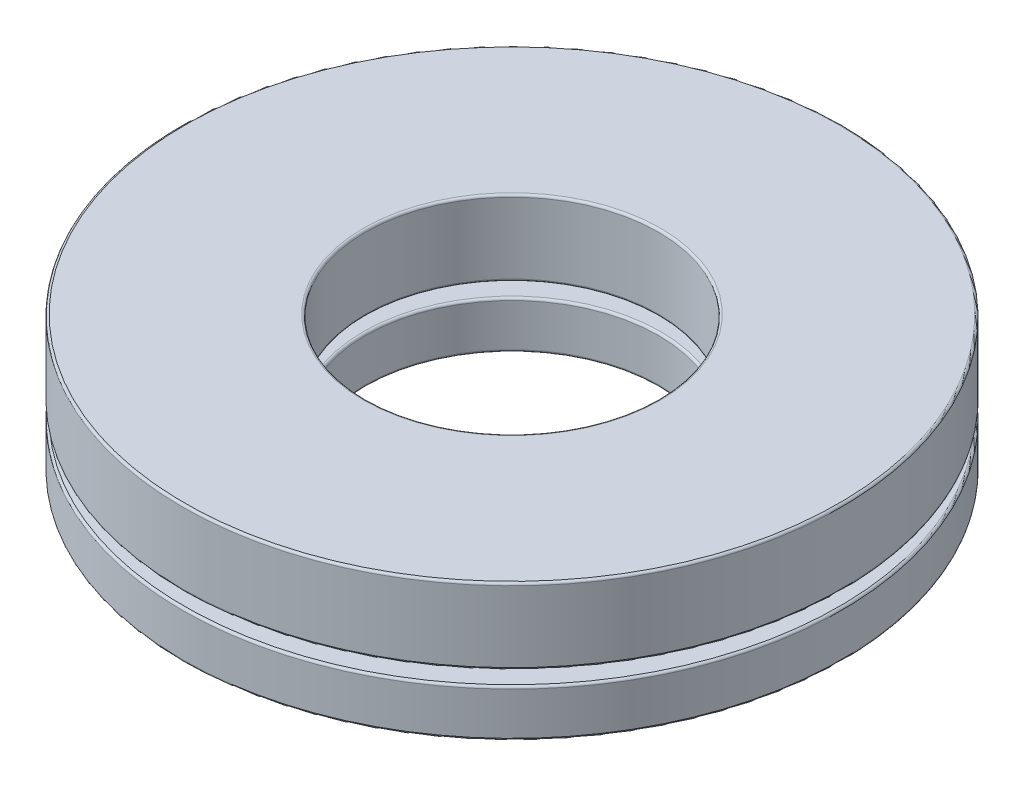
ISO-10303-21;
HEADER;
FILE_DESCRIPTION(('STEP AP214'),'2;1');
FILE_NAME('part.step','',(''),(''),'','','');
FILE_SCHEMA(('AUTOMOTIVE_DESIGN { 1 0 10303 214 1 1 1 1 }'));
ENDSEC;
DATA;
#1=APPLICATION_CONTEXT('core data for automotive mechanical design processes');
#2=APPLICATION_PROTOCOL_DEFINITION('international standard','automotive_design',2000,#1);
#3=PRODUCT_CONTEXT('',#1,'mechanical');
#4=PRODUCT('Part','Part','',(#3));
#5=PRODUCT_RELATED_PRODUCT_CATEGORY('part','',(#4));
#6=PRODUCT_DEFINITION_FORMATION('','',#4);
#7=PRODUCT_DEFINITION_CONTEXT('part definition',#1,'design');
#8=PRODUCT_DEFINITION('design','',#6,#7);
#9=PRODUCT_DEFINITION_SHAPE('','',#8);
#10=(LENGTH_UNIT() NAMED_UNIT(*) SI_UNIT(.MILLI.,.METRE.));
#11=(NAMED_UNIT(*) PLANE_ANGLE_UNIT() SI_UNIT($,.RADIAN.));
#12=(NAMED_UNIT(*) SI_UNIT($,.STERADIAN.) SOLID_ANGLE_UNIT());
#13=UNCERTAINTY_MEASURE_WITH_UNIT(LENGTH_MEASURE(1.E-05),#10,'distance_accuracy_value','');
#14=(GEOMETRIC_REPRESENTATION_CONTEXT(3) GLOBAL_UNCERTAINTY_ASSIGNED_CONTEXT((#13)) GLOBAL_UNIT_ASSIGNED_CONTEXT((#10,
#11,#12)) REPRESENTATION_CONTEXT('',''));
#15=CARTESIAN_POINT('',(0.,0.,0.));
#16=DIRECTION('',(0.,0.,1.));
#17=DIRECTION('',(1.,0.,0.));
#18=AXIS2_PLACEMENT_3D('',#15,#16,#17);
#19=CARTESIAN_POINT('',(0.,-2.4511,0.));
#20=DIRECTION('',(0.,-1.,0.));
#21=DIRECTION('',(0.,0.,-1.));
#22=AXIS2_PLACEMENT_3D('',#19,#20,#21);
#23=CYLINDRICAL_SURFACE('',#22,7.14375);
#24=CARTESIAN_POINT('',(0.,0.866055333333332,0.));
#25=DIRECTION('',(0.,1.,0.));
#26=DIRECTION('',(0.,0.,1.));
#27=AXIS2_PLACEMENT_3D('',#24,#25,#26);
#28=CIRCLE('',#27,7.14375);
#29=CARTESIAN_POINT('',(0.,0.866055333333332,7.14375));
#30=VERTEX_POINT('',#29);
#31=EDGE_CURVE('E11',#30,#30,#28,.T.);
#32=ORIENTED_EDGE('',*,*,#31,.T.);
#33=EDGE_LOOP('',(#32));
#34=FACE_BOUND('',#33,.T.);
#35=CARTESIAN_POINT('',(0.,2.402078,0.));
#36=DIRECTION('',(0.,-1.,0.));
#37=DIRECTION('',(0.,0.,-1.));
#38=AXIS2_PLACEMENT_3D('',#35,#36,#37);
#39=CIRCLE('',#38,7.14375);
#40=CARTESIAN_POINT('',(0.,2.402078,-7.14375));
#41=VERTEX_POINT('',#40);
#42=EDGE_CURVE('E44',#41,#41,#39,.T.);
#43=ORIENTED_EDGE('',*,*,#42,.T.);
#44=EDGE_LOOP('',(#43));
#45=FACE_BOUND('',#44,.T.);
#46=ADVANCED_FACE('F37',(#34,#45),#23,.T.);
#47=CARTESIAN_POINT('',(0.,2.4511,7.14375));
#48=DIRECTION('',(0.,-1.,0.));
#49=DIRECTION('',(0.,0.,-1.));
#50=AXIS2_PLACEMENT_3D('',#47,#48,#49);
#51=PLANE('',#50);
#52=CARTESIAN_POINT('',(0.,2.4511,0.));
#53=DIRECTION('',(0.,-1.,0.));
#54=DIRECTION('',(0.,0.,-1.));
#55=AXIS2_PLACEMENT_3D('',#52,#53,#54);
#56=CIRCLE('',#55,3.224022);
#57=CARTESIAN_POINT('',(0.,2.4511,-3.224022));
#58=VERTEX_POINT('',#57);
#59=EDGE_CURVE('E48',#58,#58,#56,.T.);
#60=ORIENTED_EDGE('',*,*,#59,.T.);
#61=EDGE_LOOP('',(#60));
#62=FACE_BOUND('',#61,.T.);
#63=CARTESIAN_POINT('',(0.,2.4511,0.));
#64=DIRECTION('',(0.,-1.,0.));
#65=DIRECTION('',(0.,0.,-1.));
#66=AXIS2_PLACEMENT_3D('',#63,#64,#65);
#67=CIRCLE('',#66,7.094728);
#68=CARTESIAN_POINT('',(0.,2.4511,-7.094728));
#69=VERTEX_POINT('',#68);
#70=EDGE_CURVE('E52',#69,#69,#67,.F.);
#71=ORIENTED_EDGE('',*,*,#70,.T.);
#72=EDGE_LOOP('',(#71));
#73=FACE_BOUND('',#72,.T.);
#74=ADVANCED_FACE('F80',(#62,#73),#51,.F.);
#75=CARTESIAN_POINT('',(0.,-2.4511,0.));
#76=DIRECTION('',(0.,-1.,0.));
#77=DIRECTION('',(0.,0.,-1.));
#78=AXIS2_PLACEMENT_3D('',#75,#76,#77);
#79=CYLINDRICAL_SURFACE('',#78,3.175);
#80=CARTESIAN_POINT('',(0.,0.866055333333332,0.));
#81=DIRECTION('',(0.,1.,0.));
#82=DIRECTION('',(0.,0.,1.));
#83=AXIS2_PLACEMENT_3D('',#80,#81,#82);
#84=CIRCLE('',#83,3.175);
#85=CARTESIAN_POINT('',(0.,0.866055333333332,3.175));
#86=VERTEX_POINT('',#85);
#87=EDGE_CURVE('E63',#86,#86,#84,.F.);
#88=ORIENTED_EDGE('',*,*,#87,.T.);
#89=EDGE_LOOP('',(#88));
#90=FACE_BOUND('',#89,.T.);
#91=CARTESIAN_POINT('',(0.,2.402078,0.));
#92=DIRECTION('',(0.,-1.,0.));
#93=DIRECTION('',(0.,0.,-1.));
#94=AXIS2_PLACEMENT_3D('',#91,#92,#93);
#95=CIRCLE('',#94,3.175);
#96=CARTESIAN_POINT('',(0.,2.402078,-3.175));
#97=VERTEX_POINT('',#96);
#98=EDGE_CURVE('E66',#97,#97,#95,.F.);
#99=ORIENTED_EDGE('',*,*,#98,.T.);
#100=EDGE_LOOP('',(#99));
#101=FACE_BOUND('',#100,.T.);
#102=ADVANCED_FACE('F70',(#90,#101),#79,.F.);
#103=CARTESIAN_POINT('',(0.,0.817033333333333,7.14375));
#104=DIRECTION('',(0.,1.,0.));
#105=DIRECTION('',(0.,0.,1.));
#106=AXIS2_PLACEMENT_3D('',#103,#104,#105);
#107=PLANE('',#106);
#108=CARTESIAN_POINT('',(0.,0.817033333333333,0.));
#109=DIRECTION('',(0.,1.,0.));
#110=DIRECTION('',(0.,0.,1.));
#111=AXIS2_PLACEMENT_3D('',#108,#109,#110);
#112=CIRCLE('',#111,3.224022);
#113=CARTESIAN_POINT('',(0.,0.817033333333333,3.224022));
#114=VERTEX_POINT('',#113);
#115=EDGE_CURVE('E57',#114,#114,#112,.T.);
#116=ORIENTED_EDGE('',*,*,#115,.T.);
#117=EDGE_LOOP('',(#116));
#118=FACE_BOUND('',#117,.T.);
#119=CARTESIAN_POINT('',(0.,0.817033333333333,0.));
#120=DIRECTION('',(0.,1.,0.));
#121=DIRECTION('',(0.,0.,1.));
#122=AXIS2_PLACEMENT_3D('',#119,#120,#121);
#123=CIRCLE('',#122,7.094728);
#124=CARTESIAN_POINT('',(0.,0.817033333333333,7.094728));
#125=VERTEX_POINT('',#124);
#126=EDGE_CURVE('E60',#125,#125,#123,.F.);
#127=ORIENTED_EDGE('',*,*,#126,.T.);
#128=EDGE_LOOP('',(#127));
#129=FACE_BOUND('',#128,.T.);
#130=ADVANCED_FACE('F99',(#118,#129),#107,.F.);
#131=CARTESIAN_POINT('',(0.,0.866055333333332,0.));
#132=DIRECTION('',(0.,1.,0.));
#133=DIRECTION('',(0.,0.,1.));
#134=AXIS2_PLACEMENT_3D('',#131,#132,#133);
#135=TOROIDAL_SURFACE('',#134,3.224022,0.049022);
#136=ORIENTED_EDGE('',*,*,#115,.F.);
#137=EDGE_LOOP('',(#136));
#138=FACE_BOUND('',#137,.T.);
#139=ORIENTED_EDGE('',*,*,#87,.F.);
#140=EDGE_LOOP('',(#139));
#141=FACE_BOUND('',#140,.T.);
#142=ADVANCED_FACE('F76',(#138,#141),#135,.T.);
#143=CARTESIAN_POINT('',(0.,2.402078,0.));
#144=DIRECTION('',(0.,-1.,0.));
#145=DIRECTION('',(0.,0.,-1.));
#146=AXIS2_PLACEMENT_3D('',#143,#144,#145);
#147=TOROIDAL_SURFACE('',#146,3.224022,0.049022);
#148=ORIENTED_EDGE('',*,*,#98,.F.);
#149=EDGE_LOOP('',(#148));
#150=FACE_BOUND('',#149,.T.);
#151=ORIENTED_EDGE('',*,*,#59,.F.);
#152=EDGE_LOOP('',(#151));
#153=FACE_BOUND('',#152,.T.);
#154=ADVANCED_FACE('F72',(#150,#153),#147,.T.);
#155=CARTESIAN_POINT('',(0.,0.866055333333332,0.));
#156=DIRECTION('',(0.,1.,0.));
#157=DIRECTION('',(0.,0.,1.));
#158=AXIS2_PLACEMENT_3D('',#155,#156,#157);
#159=TOROIDAL_SURFACE('',#158,7.094728,0.049022);
#160=ORIENTED_EDGE('',*,*,#31,.F.);
#161=EDGE_LOOP('',(#160));
#162=FACE_BOUND('',#161,.T.);
#163=ORIENTED_EDGE('',*,*,#126,.F.);
#164=EDGE_LOOP('',(#163));
#165=FACE_BOUND('',#164,.T.);
#166=ADVANCED_FACE('F75',(#162,#165),#159,.T.);
#167=CARTESIAN_POINT('',(0.,2.402078,0.));
#168=DIRECTION('',(0.,-1.,0.));
#169=DIRECTION('',(0.,0.,-1.));
#170=AXIS2_PLACEMENT_3D('',#167,#168,#169);
#171=TOROIDAL_SURFACE('',#170,7.094728,0.049022);
#172=ORIENTED_EDGE('',*,*,#70,.F.);
#173=EDGE_LOOP('',(#172));
#174=FACE_BOUND('',#173,.T.);
#175=ORIENTED_EDGE('',*,*,#42,.F.);
#176=EDGE_LOOP('',(#175));
#177=FACE_BOUND('',#176,.T.);
#178=ADVANCED_FACE('F39',(#174,#177),#171,.T.);
#179=CLOSED_SHELL('',(#46,#74,#102,#130,#142,#154,#166,#178));
#180=MANIFOLD_SOLID_BREP('B2',#179);
#181=CARTESIAN_POINT('',(-4.03376180485845,0.,3.21681769646495));
#182=DIRECTION('',(0.,1.,0.));
#183=DIRECTION('',(0.781831482468022,0.,-0.623489801858743));
#184=AXIS2_PLACEMENT_3D('',#181,#182,#183);
#185=SPHERICAL_SURFACE('',#184,0.817033333333333);
#186=CARTESIAN_POINT('',(-4.03376180485845,0.817033333333333,3.21681769646495));
#187=VERTEX_POINT('',#186);
#188=VERTEX_LOOP('',#187);
#189=FACE_BOUND('',#188,.T.);
#190=ADVANCED_FACE('F164',(#189),#185,.T.);
#191=CLOSED_SHELL('',(#190));
#192=MANIFOLD_SOLID_BREP('B6',#191);
#193=CARTESIAN_POINT('',(-5.03001869691311,0.,-1.14806894363081));
#194=DIRECTION('',(0.,1.,0.));
#195=DIRECTION('',(0.974927912181826,0.,0.222520933956305));
#196=AXIS2_PLACEMENT_3D('',#193,#194,#195);
#197=SPHERICAL_SURFACE('',#196,0.817033333333333);
#198=CARTESIAN_POINT('',(-5.03001869691311,0.817033333333333,-1.14806894363081));
#199=VERTEX_POINT('',#198);
#200=VERTEX_LOOP('',#199);
#201=FACE_BOUND('',#200,.T.);
#202=ADVANCED_FACE('F182',(#201),#197,.T.);
#203=CLOSED_SHELL('',(#202));
#204=MANIFOLD_SOLID_BREP('B33',#203);
#205=CARTESIAN_POINT('',(-2.23856891650969,0.,-4.64843625283403));
#206=DIRECTION('',(0.,1.,0.));
#207=DIRECTION('',(0.433883739117565,0.,0.900968867902416));
#208=AXIS2_PLACEMENT_3D('',#205,#206,#207);
#209=SPHERICAL_SURFACE('',#208,0.817033333333333);
#210=CARTESIAN_POINT('',(-2.23856891650969,0.817033333333333,-4.64843625283403));
#211=VERTEX_POINT('',#210);
#212=VERTEX_LOOP('',#211);
#213=FACE_BOUND('',#212,.T.);
#214=ADVANCED_FACE('F200',(#213),#209,.T.);
#215=CLOSED_SHELL('',(#214));
#216=MANIFOLD_SOLID_BREP('B160',#215);
#217=CARTESIAN_POINT('',(2.23856891650962,0.,-4.64843625283406));
#218=DIRECTION('',(0.,1.,0.));
#219=DIRECTION('',(-0.433883739117553,0.,0.900968867902422));
#220=AXIS2_PLACEMENT_3D('',#217,#218,#219);
#221=SPHERICAL_SURFACE('',#220,0.817033333333333);
#222=CARTESIAN_POINT('',(2.23856891650962,0.817033333333333,-4.64843625283406));
#223=VERTEX_POINT('',#222);
#224=VERTEX_LOOP('',#223);
#225=FACE_BOUND('',#224,.T.);
#226=ADVANCED_FACE('F218',(#225),#221,.T.);
#227=CLOSED_SHELL('',(#226));
#228=MANIFOLD_SOLID_BREP('B178',#227);
#229=CARTESIAN_POINT('',(5.03001869691309,0.,-1.14806894363088));
#230=DIRECTION('',(0.,1.,0.));
#231=DIRECTION('',(-0.974927912181823,0.,0.222520933956318));
#232=AXIS2_PLACEMENT_3D('',#229,#230,#231);
#233=SPHERICAL_SURFACE('',#232,0.817033333333333);
#234=CARTESIAN_POINT('',(5.03001869691309,0.817033333333333,-1.14806894363088));
#235=VERTEX_POINT('',#234);
#236=VERTEX_LOOP('',#235);
#237=FACE_BOUND('',#236,.T.);
#238=ADVANCED_FACE('F236',(#237),#233,.T.);
#239=CLOSED_SHELL('',(#238));
#240=MANIFOLD_SOLID_BREP('B196',#239);
#241=CARTESIAN_POINT('',(4.0337618048585,0.,3.2168176964649));
#242=DIRECTION('',(0.,1.,0.));
#243=DIRECTION('',(-0.781831482468031,0.,-0.623489801858732));
#244=AXIS2_PLACEMENT_3D('',#241,#242,#243);
#245=SPHERICAL_SURFACE('',#244,0.817033333333333);
#246=CARTESIAN_POINT('',(4.0337618048585,0.817033333333333,3.2168176964649));
#247=VERTEX_POINT('',#246);
#248=VERTEX_LOOP('',#247);
#249=FACE_BOUND('',#248,.T.);
#250=ADVANCED_FACE('F254',(#249),#245,.T.);
#251=CLOSED_SHELL('',(#250));
#252=MANIFOLD_SOLID_BREP('B214',#251);
#253=CARTESIAN_POINT('',(0.,0.,5.159375));
#254=DIRECTION('',(0.,1.,0.));
#255=DIRECTION('',(0.,0.,-1.));
#256=AXIS2_PLACEMENT_3D('',#253,#254,#255);
#257=SPHERICAL_SURFACE('',#256,0.817033333333333);
#258=CARTESIAN_POINT('',(0.,0.817033333333333,5.159375));
#259=VERTEX_POINT('',#258);
#260=VERTEX_LOOP('',#259);
#261=FACE_BOUND('',#260,.T.);
#262=ADVANCED_FACE('F273',(#261),#257,.T.);
#263=CLOSED_SHELL('',(#262));
#264=MANIFOLD_SOLID_BREP('B232',#263);
#265=CARTESIAN_POINT('',(0.,-2.4511,0.));
#266=DIRECTION('',(0.,-1.,0.));
#267=DIRECTION('',(0.,0.,-1.));
#268=AXIS2_PLACEMENT_3D('',#265,#266,#267);
#269=CYLINDRICAL_SURFACE('',#268,7.14375);
#270=CARTESIAN_POINT('',(0.,-0.461623833333338,0.));
#271=DIRECTION('',(0.,1.,0.));
#272=DIRECTION('',(0.,0.,1.));
#273=AXIS2_PLACEMENT_3D('',#270,#271,#272);
#274=CIRCLE('',#273,7.14375);
#275=CARTESIAN_POINT('',(0.,-0.461623833333338,7.14375));
#276=VERTEX_POINT('',#275);
#277=EDGE_CURVE('E272',#276,#276,#274,.T.);
#278=ORIENTED_EDGE('',*,*,#277,.T.);
#279=EDGE_LOOP('',(#278));
#280=FACE_BOUND('',#279,.T.);
#281=CARTESIAN_POINT('',(0.,0.461623833333328,0.));
#282=DIRECTION('',(0.,-1.,0.));
#283=DIRECTION('',(0.,0.,-1.));
#284=AXIS2_PLACEMENT_3D('',#281,#282,#283);
#285=CIRCLE('',#284,7.14375);
#286=CARTESIAN_POINT('',(0.,0.461623833333328,-7.14375));
#287=VERTEX_POINT('',#286);
#288=EDGE_CURVE('E292',#287,#287,#285,.T.);
#289=ORIENTED_EDGE('',*,*,#288,.T.);
#290=EDGE_LOOP('',(#289));
#291=FACE_BOUND('',#290,.T.);
#292=ADVANCED_FACE('F285',(#280,#291),#269,.T.);
#293=CARTESIAN_POINT('',(0.,-0.510645833333338,7.14375));
#294=DIRECTION('',(0.,1.,0.));
#295=DIRECTION('',(0.,0.,1.));
#296=AXIS2_PLACEMENT_3D('',#293,#294,#295);
#297=PLANE('',#296);
#298=CARTESIAN_POINT('',(0.,-0.510645833333338,0.));
#299=DIRECTION('',(0.,1.,0.));
#300=DIRECTION('',(0.,0.,1.));
#301=AXIS2_PLACEMENT_3D('',#298,#299,#300);
#302=CIRCLE('',#301,3.224022);
#303=CARTESIAN_POINT('',(0.,-0.510645833333338,3.224022));
#304=VERTEX_POINT('',#303);
#305=EDGE_CURVE('E305',#304,#304,#302,.T.);
#306=ORIENTED_EDGE('',*,*,#305,.T.);
#307=EDGE_LOOP('',(#306));
#308=FACE_BOUND('',#307,.T.);
#309=CARTESIAN_POINT('',(0.,-0.510645833333338,0.));
#310=DIRECTION('',(0.,1.,0.));
#311=DIRECTION('',(0.,0.,1.));
#312=AXIS2_PLACEMENT_3D('',#309,#310,#311);
#313=CIRCLE('',#312,7.094728);
#314=CARTESIAN_POINT('',(0.,-0.510645833333338,7.094728));
#315=VERTEX_POINT('',#314);
#316=EDGE_CURVE('E308',#315,#315,#313,.F.);
#317=ORIENTED_EDGE('',*,*,#316,.T.);
#318=EDGE_LOOP('',(#317));
#319=FACE_BOUND('',#318,.T.);
#320=CARTESIAN_POINT('',(-4.03376180485845,-0.510645833333338,3.21681769646495));
#321=DIRECTION('',(0.,1.,0.));
#322=DIRECTION('',(-0.781831482468022,0.,0.623489801858743));
#323=AXIS2_PLACEMENT_3D('',#320,#321,#322);
#324=CIRCLE('',#323,0.637796441411426);
#325=CARTESIAN_POINT('',(-4.53241114215998,-0.510645833333338,3.61447727334677));
#326=VERTEX_POINT('',#325);
#327=EDGE_CURVE('E353',#326,#326,#324,.T.);
#328=ORIENTED_EDGE('',*,*,#327,.T.);
#329=EDGE_LOOP('',(#328));
#330=FACE_BOUND('',#329,.T.);
#331=CARTESIAN_POINT('',(-5.03001869691311,-0.510645833333338,-1.14806894363081));
#332=DIRECTION('',(0.,1.,0.));
#333=DIRECTION('',(-0.974927912181826,0.,-0.222520933956305));
#334=AXIS2_PLACEMENT_3D('',#331,#332,#333);
#335=CIRCLE('',#334,0.637796441411426);
#336=CARTESIAN_POINT('',(-5.65182424993535,-0.510645833333338,-1.28999200344769));
#337=VERTEX_POINT('',#336);
#338=EDGE_CURVE('E347',#337,#337,#335,.T.);
#339=ORIENTED_EDGE('',*,*,#338,.T.);
#340=EDGE_LOOP('',(#339));
#341=FACE_BOUND('',#340,.T.);
#342=CARTESIAN_POINT('',(-2.23856891650969,-0.510645833333338,-4.64843625283403));
#343=DIRECTION('',(0.,1.,0.));
#344=DIRECTION('',(-0.433883739117565,0.,-0.900968867902416));
#345=AXIS2_PLACEMENT_3D('',#342,#343,#344);
#346=CIRCLE('',#345,0.637796441411426);
#347=CARTESIAN_POINT('',(-2.51529842130515,-0.510645833333338,-5.22307099060467));
#348=VERTEX_POINT('',#347);
#349=EDGE_CURVE('E341',#348,#348,#346,.T.);
#350=ORIENTED_EDGE('',*,*,#349,.T.);
#351=EDGE_LOOP('',(#350));
#352=FACE_BOUND('',#351,.T.);
#353=CARTESIAN_POINT('',(2.23856891650962,-0.510645833333338,-4.64843625283406));
#354=DIRECTION('',(0.,1.,0.));
#355=DIRECTION('',(0.433883739117553,0.,-0.900968867902422));
#356=AXIS2_PLACEMENT_3D('',#353,#354,#355);
#357=CIRCLE('',#356,0.637796441411426);
#358=CARTESIAN_POINT('',(2.51529842130508,-0.510645833333338,-5.2230709906047));
#359=VERTEX_POINT('',#358);
#360=EDGE_CURVE('E335',#359,#359,#357,.T.);
#361=ORIENTED_EDGE('',*,*,#360,.T.);
#362=EDGE_LOOP('',(#361));
#363=FACE_BOUND('',#362,.T.);
#364=CARTESIAN_POINT('',(5.03001869691309,-0.510645833333338,-1.14806894363088));
#365=DIRECTION('',(0.,1.,0.));
#366=DIRECTION('',(0.974927912181823,0.,-0.222520933956318));
#367=AXIS2_PLACEMENT_3D('',#364,#365,#366);
#368=CIRCLE('',#367,0.637796441411426);
#369=CARTESIAN_POINT('',(5.65182424993533,-0.510645833333338,-1.28999200344777));
#370=VERTEX_POINT('',#369);
#371=EDGE_CURVE('E329',#370,#370,#368,.T.);
#372=ORIENTED_EDGE('',*,*,#371,.T.);
#373=EDGE_LOOP('',(#372));
#374=FACE_BOUND('',#373,.T.);
#375=CARTESIAN_POINT('',(4.0337618048585,-0.510645833333338,3.2168176964649));
#376=DIRECTION('',(0.,1.,0.));
#377=DIRECTION('',(0.781831482468031,0.,0.623489801858732));
#378=AXIS2_PLACEMENT_3D('',#375,#376,#377);
#379=CIRCLE('',#378,0.637796441411426);
#380=CARTESIAN_POINT('',(4.53241114216003,-0.510645833333338,3.61447727334671));
#381=VERTEX_POINT('',#380);
#382=EDGE_CURVE('E321',#381,#381,#379,.T.);
#383=ORIENTED_EDGE('',*,*,#382,.T.);
#384=EDGE_LOOP('',(#383));
#385=FACE_BOUND('',#384,.T.);
#386=CARTESIAN_POINT('',(0.,-0.510645833333338,5.159375));
#387=DIRECTION('',(0.,1.,0.));
#388=DIRECTION('',(0.,0.,1.));
#389=AXIS2_PLACEMENT_3D('',#386,#387,#388);
#390=CIRCLE('',#389,0.637796441411426);
#391=CARTESIAN_POINT('',(0.,-0.510645833333338,5.79717144141143));
#392=VERTEX_POINT('',#391);
#393=EDGE_CURVE('E317',#392,#392,#390,.T.);
#394=ORIENTED_EDGE('',*,*,#393,.T.);
#395=EDGE_LOOP('',(#394));
#396=FACE_BOUND('',#395,.T.);
#397=ADVANCED_FACE('F371',(#308,#319,#330,#341,#352,#363,#374,#385,#396),#297,.F.);
#398=CARTESIAN_POINT('',(0.,-2.4511,0.));
#399=DIRECTION('',(0.,-1.,0.));
#400=DIRECTION('',(0.,0.,-1.));
#401=AXIS2_PLACEMENT_3D('',#398,#399,#400);
#402=CYLINDRICAL_SURFACE('',#401,3.175);
#403=CARTESIAN_POINT('',(0.,-0.461623833333338,0.));
#404=DIRECTION('',(0.,1.,0.));
#405=DIRECTION('',(0.,0.,1.));
#406=AXIS2_PLACEMENT_3D('',#403,#404,#405);
#407=CIRCLE('',#406,3.175);
#408=CARTESIAN_POINT('',(0.,-0.461623833333338,3.175));
#409=VERTEX_POINT('',#408);
#410=EDGE_CURVE('E311',#409,#409,#407,.F.);
#411=ORIENTED_EDGE('',*,*,#410,.T.);
#412=EDGE_LOOP('',(#411));
#413=FACE_BOUND('',#412,.T.);
#414=CARTESIAN_POINT('',(0.,0.461623833333328,0.));
#415=DIRECTION('',(0.,-1.,0.));
#416=DIRECTION('',(0.,0.,-1.));
#417=AXIS2_PLACEMENT_3D('',#414,#415,#416);
#418=CIRCLE('',#417,3.175);
#419=CARTESIAN_POINT('',(0.,0.461623833333328,-3.175));
#420=VERTEX_POINT('',#419);
#421=EDGE_CURVE('E314',#420,#420,#418,.F.);
#422=ORIENTED_EDGE('',*,*,#421,.T.);
#423=EDGE_LOOP('',(#422));
#424=FACE_BOUND('',#423,.T.);
#425=ADVANCED_FACE('F374',(#413,#424),#402,.F.);
#426=CARTESIAN_POINT('',(0.,0.510645833333328,7.14375));
#427=DIRECTION('',(0.,-1.,0.));
#428=DIRECTION('',(0.,0.,-1.));
#429=AXIS2_PLACEMENT_3D('',#426,#427,#428);
#430=PLANE('',#429);
#431=CARTESIAN_POINT('',(0.,0.510645833333328,0.));
#432=DIRECTION('',(0.,-1.,0.));
#433=DIRECTION('',(0.,0.,-1.));
#434=AXIS2_PLACEMENT_3D('',#431,#432,#433);
#435=CIRCLE('',#434,3.224022);
#436=CARTESIAN_POINT('',(0.,0.510645833333328,-3.224022));
#437=VERTEX_POINT('',#436);
#438=EDGE_CURVE('E296',#437,#437,#435,.T.);
#439=ORIENTED_EDGE('',*,*,#438,.T.);
#440=EDGE_LOOP('',(#439));
#441=FACE_BOUND('',#440,.T.);
#442=CARTESIAN_POINT('',(0.,0.510645833333328,0.));
#443=DIRECTION('',(0.,-1.,0.));
#444=DIRECTION('',(0.,0.,-1.));
#445=AXIS2_PLACEMENT_3D('',#442,#443,#444);
#446=CIRCLE('',#445,7.094728);
#447=CARTESIAN_POINT('',(0.,0.510645833333328,-7.094728));
#448=VERTEX_POINT('',#447);
#449=EDGE_CURVE('E300',#448,#448,#446,.F.);
#450=ORIENTED_EDGE('',*,*,#449,.T.);
#451=EDGE_LOOP('',(#450));
#452=FACE_BOUND('',#451,.T.);
#453=CARTESIAN_POINT('',(-4.03376180485845,0.510645833333328,3.21681769646495));
#454=DIRECTION('',(0.,-1.,0.));
#455=DIRECTION('',(0.781831482468022,0.,-0.623489801858743));
#456=AXIS2_PLACEMENT_3D('',#453,#454,#455);
#457=CIRCLE('',#456,0.637796441411434);
#458=CARTESIAN_POINT('',(-3.53511246755692,0.510645833333328,2.81915811958313));
#459=VERTEX_POINT('',#458);
#460=EDGE_CURVE('E356',#459,#459,#457,.T.);
#461=ORIENTED_EDGE('',*,*,#460,.T.);
#462=EDGE_LOOP('',(#461));
#463=FACE_BOUND('',#462,.T.);
#464=CARTESIAN_POINT('',(-5.03001869691311,0.510645833333328,-1.14806894363081));
#465=DIRECTION('',(0.,-1.,0.));
#466=DIRECTION('',(0.974927912181826,0.,0.222520933956305));
#467=AXIS2_PLACEMENT_3D('',#464,#465,#466);
#468=CIRCLE('',#467,0.637796441411434);
#469=CARTESIAN_POINT('',(-4.40821314389086,0.510645833333328,-1.00614588381393));
#470=VERTEX_POINT('',#469);
#471=EDGE_CURVE('E350',#470,#470,#468,.T.);
#472=ORIENTED_EDGE('',*,*,#471,.T.);
#473=EDGE_LOOP('',(#472));
#474=FACE_BOUND('',#473,.T.);
#475=CARTESIAN_POINT('',(-2.23856891650969,0.510645833333328,-4.64843625283403));
#476=DIRECTION('',(0.,-1.,0.));
#477=DIRECTION('',(0.433883739117565,0.,0.900968867902416));
#478=AXIS2_PLACEMENT_3D('',#475,#476,#477);
#479=CIRCLE('',#478,0.637796441411434);
#480=CARTESIAN_POINT('',(-1.96183941171422,0.510645833333328,-4.07380151506338));
#481=VERTEX_POINT('',#480);
#482=EDGE_CURVE('E344',#481,#481,#479,.T.);
#483=ORIENTED_EDGE('',*,*,#482,.T.);
#484=EDGE_LOOP('',(#483));
#485=FACE_BOUND('',#484,.T.);
#486=CARTESIAN_POINT('',(2.23856891650962,0.510645833333328,-4.64843625283406));
#487=DIRECTION('',(0.,-1.,0.));
#488=DIRECTION('',(-0.433883739117553,0.,0.900968867902422));
#489=AXIS2_PLACEMENT_3D('',#486,#487,#488);
#490=CIRCLE('',#489,0.637796441411434);
#491=CARTESIAN_POINT('',(1.96183941171416,0.510645833333328,-4.07380151506341));
#492=VERTEX_POINT('',#491);
#493=EDGE_CURVE('E338',#492,#492,#490,.T.);
#494=ORIENTED_EDGE('',*,*,#493,.T.);
#495=EDGE_LOOP('',(#494));
#496=FACE_BOUND('',#495,.T.);
#497=CARTESIAN_POINT('',(5.03001869691309,0.510645833333328,-1.14806894363088));
#498=DIRECTION('',(0.,-1.,0.));
#499=DIRECTION('',(-0.974927912181823,0.,0.222520933956318));
#500=AXIS2_PLACEMENT_3D('',#497,#498,#499);
#501=CIRCLE('',#500,0.637796441411434);
#502=CARTESIAN_POINT('',(4.40821314389085,0.510645833333328,-1.00614588381399));
#503=VERTEX_POINT('',#502);
#504=EDGE_CURVE('E332',#503,#503,#501,.T.);
#505=ORIENTED_EDGE('',*,*,#504,.T.);
#506=EDGE_LOOP('',(#505));
#507=FACE_BOUND('',#506,.T.);
#508=CARTESIAN_POINT('',(4.0337618048585,0.510645833333328,3.2168176964649));
#509=DIRECTION('',(0.,-1.,0.));
#510=DIRECTION('',(-0.781831482468031,0.,-0.623489801858732));
#511=AXIS2_PLACEMENT_3D('',#508,#509,#510);
#512=CIRCLE('',#511,0.637796441411434);
#513=CARTESIAN_POINT('',(3.53511246755696,0.510645833333328,2.81915811958308));
#514=VERTEX_POINT('',#513);
#515=EDGE_CURVE('E326',#514,#514,#512,.T.);
#516=ORIENTED_EDGE('',*,*,#515,.T.);
#517=EDGE_LOOP('',(#516));
#518=FACE_BOUND('',#517,.T.);
#519=CARTESIAN_POINT('',(0.,0.510645833333328,5.159375));
#520=DIRECTION('',(0.,-1.,0.));
#521=DIRECTION('',(0.,0.,-1.));
#522=AXIS2_PLACEMENT_3D('',#519,#520,#521);
#523=CIRCLE('',#522,0.637796441411434);
#524=CARTESIAN_POINT('',(0.,0.510645833333328,4.52157855858857));
#525=VERTEX_POINT('',#524);
#526=EDGE_CURVE('E318',#525,#525,#523,.T.);
#527=ORIENTED_EDGE('',*,*,#526,.T.);
#528=EDGE_LOOP('',(#527));
#529=FACE_BOUND('',#528,.T.);
#530=ADVANCED_FACE('F360',(#441,#452,#463,#474,#485,#496,#507,#518,#529),#430,.F.);
#531=CARTESIAN_POINT('',(0.,0.,5.159375));
#532=DIRECTION('',(0.,1.,0.));
#533=DIRECTION('',(0.,0.,-1.));
#534=AXIS2_PLACEMENT_3D('',#531,#532,#533);
#535=SPHERICAL_SURFACE('',#534,0.817033333333333);
#536=ORIENTED_EDGE('',*,*,#526,.F.);
#537=EDGE_LOOP('',(#536));
#538=FACE_BOUND('',#537,.T.);
#539=ORIENTED_EDGE('',*,*,#393,.F.);
#540=EDGE_LOOP('',(#539));
#541=FACE_BOUND('',#540,.T.);
#542=ADVANCED_FACE('F389',(#538,#541),#535,.F.);
#543=CARTESIAN_POINT('',(4.0337618048585,0.,3.2168176964649));
#544=DIRECTION('',(0.,1.,0.));
#545=DIRECTION('',(-0.781831482468031,0.,-0.623489801858732));
#546=AXIS2_PLACEMENT_3D('',#543,#544,#545);
#547=SPHERICAL_SURFACE('',#546,0.817033333333333);
#548=ORIENTED_EDGE('',*,*,#515,.F.);
#549=EDGE_LOOP('',(#548));
#550=FACE_BOUND('',#549,.T.);
#551=ORIENTED_EDGE('',*,*,#382,.F.);
#552=EDGE_LOOP('',(#551));
#553=FACE_BOUND('',#552,.T.);
#554=ADVANCED_FACE('F391',(#550,#553),#547,.F.);
#555=CARTESIAN_POINT('',(5.03001869691309,0.,-1.14806894363088));
#556=DIRECTION('',(0.,1.,0.));
#557=DIRECTION('',(-0.974927912181823,0.,0.222520933956318));
#558=AXIS2_PLACEMENT_3D('',#555,#556,#557);
#559=SPHERICAL_SURFACE('',#558,0.817033333333333);
#560=ORIENTED_EDGE('',*,*,#504,.F.);
#561=EDGE_LOOP('',(#560));
#562=FACE_BOUND('',#561,.T.);
#563=ORIENTED_EDGE('',*,*,#371,.F.);
#564=EDGE_LOOP('',(#563));
#565=FACE_BOUND('',#564,.T.);
#566=ADVANCED_FACE('F398',(#562,#565),#559,.F.);
#567=CARTESIAN_POINT('',(2.23856891650962,0.,-4.64843625283406));
#568=DIRECTION('',(0.,1.,0.));
#569=DIRECTION('',(-0.433883739117553,0.,0.900968867902422));
#570=AXIS2_PLACEMENT_3D('',#567,#568,#569);
#571=SPHERICAL_SURFACE('',#570,0.817033333333333);
#572=ORIENTED_EDGE('',*,*,#493,.F.);
#573=EDGE_LOOP('',(#572));
#574=FACE_BOUND('',#573,.T.);
#575=ORIENTED_EDGE('',*,*,#360,.F.);
#576=EDGE_LOOP('',(#575));
#577=FACE_BOUND('',#576,.T.);
#578=ADVANCED_FACE('F497',(#574,#577),#571,.F.);
#579=CARTESIAN_POINT('',(-2.23856891650969,0.,-4.64843625283403));
#580=DIRECTION('',(0.,1.,0.));
#581=DIRECTION('',(0.433883739117565,0.,0.900968867902416));
#582=AXIS2_PLACEMENT_3D('',#579,#580,#581);
#583=SPHERICAL_SURFACE('',#582,0.817033333333333);
#584=ORIENTED_EDGE('',*,*,#482,.F.);
#585=EDGE_LOOP('',(#584));
#586=FACE_BOUND('',#585,.T.);
#587=ORIENTED_EDGE('',*,*,#349,.F.);
#588=EDGE_LOOP('',(#587));
#589=FACE_BOUND('',#588,.T.);
#590=ADVANCED_FACE('F487',(#586,#589),#583,.F.);
#591=CARTESIAN_POINT('',(-5.03001869691311,0.,-1.14806894363081));
#592=DIRECTION('',(0.,1.,0.));
#593=DIRECTION('',(0.974927912181826,0.,0.222520933956305));
#594=AXIS2_PLACEMENT_3D('',#591,#592,#593);
#595=SPHERICAL_SURFACE('',#594,0.817033333333333);
#596=ORIENTED_EDGE('',*,*,#471,.F.);
#597=EDGE_LOOP('',(#596));
#598=FACE_BOUND('',#597,.T.);
#599=ORIENTED_EDGE('',*,*,#338,.F.);
#600=EDGE_LOOP('',(#599));
#601=FACE_BOUND('',#600,.T.);
#602=ADVANCED_FACE('F367',(#598,#601),#595,.F.);
#603=CARTESIAN_POINT('',(-4.03376180485845,0.,3.21681769646495));
#604=DIRECTION('',(0.,1.,0.));
#605=DIRECTION('',(0.781831482468022,0.,-0.623489801858743));
#606=AXIS2_PLACEMENT_3D('',#603,#604,#605);
#607=SPHERICAL_SURFACE('',#606,0.817033333333333);
#608=ORIENTED_EDGE('',*,*,#460,.F.);
#609=EDGE_LOOP('',(#608));
#610=FACE_BOUND('',#609,.T.);
#611=ORIENTED_EDGE('',*,*,#327,.F.);
#612=EDGE_LOOP('',(#611));
#613=FACE_BOUND('',#612,.T.);
#614=ADVANCED_FACE('F363',(#610,#613),#607,.F.);
#615=CARTESIAN_POINT('',(0.,-0.461623833333338,0.));
#616=DIRECTION('',(0.,1.,0.));
#617=DIRECTION('',(0.,0.,1.));
#618=AXIS2_PLACEMENT_3D('',#615,#616,#617);
#619=TOROIDAL_SURFACE('',#618,3.224022,0.049022);
#620=ORIENTED_EDGE('',*,*,#305,.F.);
#621=EDGE_LOOP('',(#620));
#622=FACE_BOUND('',#621,.T.);
#623=ORIENTED_EDGE('',*,*,#410,.F.);
#624=EDGE_LOOP('',(#623));
#625=FACE_BOUND('',#624,.T.);
#626=ADVANCED_FACE('F366',(#622,#625),#619,.T.);
#627=CARTESIAN_POINT('',(0.,0.461623833333328,0.));
#628=DIRECTION('',(0.,-1.,0.));
#629=DIRECTION('',(0.,0.,-1.));
#630=AXIS2_PLACEMENT_3D('',#627,#628,#629);
#631=TOROIDAL_SURFACE('',#630,3.224022,0.049022);
#632=ORIENTED_EDGE('',*,*,#421,.F.);
#633=EDGE_LOOP('',(#632));
#634=FACE_BOUND('',#633,.T.);
#635=ORIENTED_EDGE('',*,*,#438,.F.);
#636=EDGE_LOOP('',(#635));
#637=FACE_BOUND('',#636,.T.);
#638=ADVANCED_FACE('F412',(#634,#637),#631,.T.);
#639=CARTESIAN_POINT('',(0.,-0.461623833333338,0.));
#640=DIRECTION('',(0.,1.,0.));
#641=DIRECTION('',(0.,0.,1.));
#642=AXIS2_PLACEMENT_3D('',#639,#640,#641);
#643=TOROIDAL_SURFACE('',#642,7.094728,0.049022);
#644=ORIENTED_EDGE('',*,*,#277,.F.);
#645=EDGE_LOOP('',(#644));
#646=FACE_BOUND('',#645,.T.);
#647=ORIENTED_EDGE('',*,*,#316,.F.);
#648=EDGE_LOOP('',(#647));
#649=FACE_BOUND('',#648,.T.);
#650=ADVANCED_FACE('F415',(#646,#649),#643,.T.);
#651=CARTESIAN_POINT('',(0.,0.461623833333328,0.));
#652=DIRECTION('',(0.,-1.,0.));
#653=DIRECTION('',(0.,0.,-1.));
#654=AXIS2_PLACEMENT_3D('',#651,#652,#653);
#655=TOROIDAL_SURFACE('',#654,7.094728,0.049022);
#656=ORIENTED_EDGE('',*,*,#449,.F.);
#657=EDGE_LOOP('',(#656));
#658=FACE_BOUND('',#657,.T.);
#659=ORIENTED_EDGE('',*,*,#288,.F.);
#660=EDGE_LOOP('',(#659));
#661=FACE_BOUND('',#660,.T.);
#662=ADVANCED_FACE('F287',(#658,#661),#655,.T.);
#663=CLOSED_SHELL('',(#292,#397,#425,#530,#542,#554,#566,#578,#590,#602,#614,#626,#638,#650,#662));
#664=MANIFOLD_SOLID_BREP('B250',#663);
#665=ADVANCED_BREP_SHAPE_REPRESENTATION('',(#18,#180,#192,#204,#216,#228,#240,#252,#264,#664),#14);
#666=SHAPE_DEFINITION_REPRESENTATION(#9,#665);
ENDSEC;
END-ISO-10303-21;
